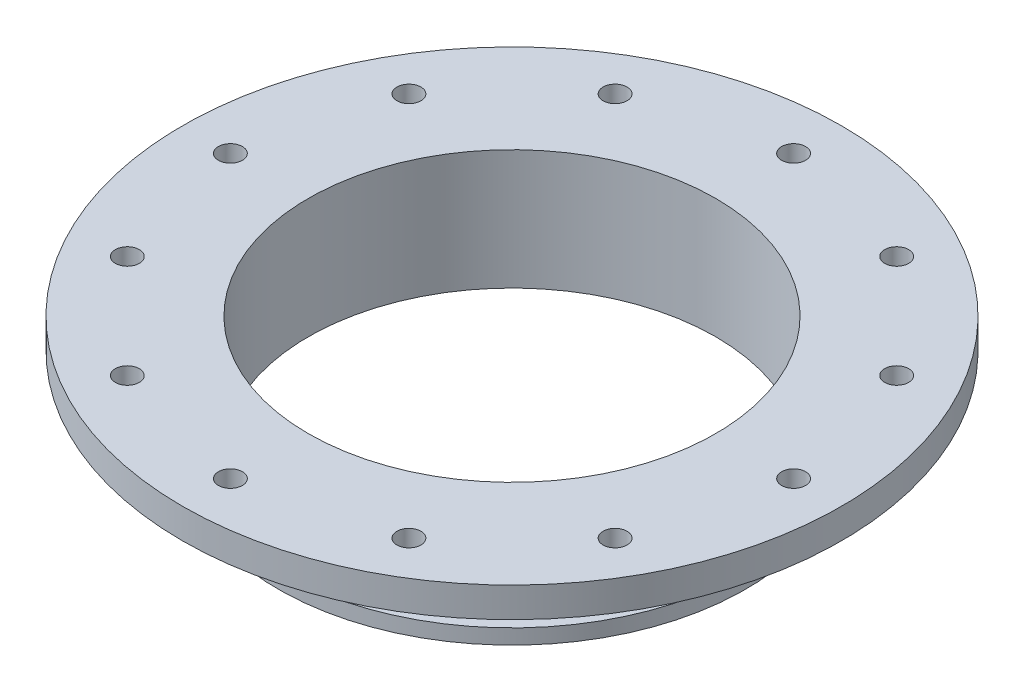
ISO-10303-21;
HEADER;
FILE_DESCRIPTION(('STEP AP214'),'2;1');
FILE_NAME('part.step','',(''),(''),'','','');
FILE_SCHEMA(('AUTOMOTIVE_DESIGN { 1 0 10303 214 1 1 1 1 }'));
ENDSEC;
DATA;
#1=APPLICATION_CONTEXT('core data for automotive mechanical design processes');
#2=APPLICATION_PROTOCOL_DEFINITION('international standard','automotive_design',2000,#1);
#3=PRODUCT_CONTEXT('',#1,'mechanical');
#4=PRODUCT('Part','Part','',(#3));
#5=PRODUCT_RELATED_PRODUCT_CATEGORY('part','',(#4));
#6=PRODUCT_DEFINITION_FORMATION('','',#4);
#7=PRODUCT_DEFINITION_CONTEXT('part definition',#1,'design');
#8=PRODUCT_DEFINITION('design','',#6,#7);
#9=PRODUCT_DEFINITION_SHAPE('','',#8);
#10=(LENGTH_UNIT() NAMED_UNIT(*) SI_UNIT(.MILLI.,.METRE.));
#11=(NAMED_UNIT(*) PLANE_ANGLE_UNIT() SI_UNIT($,.RADIAN.));
#12=(NAMED_UNIT(*) SI_UNIT($,.STERADIAN.) SOLID_ANGLE_UNIT());
#13=UNCERTAINTY_MEASURE_WITH_UNIT(LENGTH_MEASURE(1.E-05),#10,'distance_accuracy_value','');
#14=(GEOMETRIC_REPRESENTATION_CONTEXT(3) GLOBAL_UNCERTAINTY_ASSIGNED_CONTEXT((#13)) GLOBAL_UNIT_ASSIGNED_CONTEXT((#10,
#11,#12)) REPRESENTATION_CONTEXT('',''));
#15=CARTESIAN_POINT('',(0.,0.,0.));
#16=DIRECTION('',(0.,0.,1.));
#17=DIRECTION('',(1.,0.,0.));
#18=AXIS2_PLACEMENT_3D('',#15,#16,#17);
#19=CARTESIAN_POINT('',(0.,-25.4,0.));
#20=DIRECTION('',(0.,1.,0.));
#21=DIRECTION('',(0.,0.,1.));
#22=AXIS2_PLACEMENT_3D('',#19,#20,#21);
#23=CYLINDRICAL_SURFACE('',#22,49.53);
#24=CARTESIAN_POINT('',(0.,-6.35,0.));
#25=DIRECTION('',(0.,-1.,0.));
#26=DIRECTION('',(0.,0.,-1.));
#27=AXIS2_PLACEMENT_3D('',#24,#25,#26);
#28=CIRCLE('',#27,49.53);
#29=CARTESIAN_POINT('',(0.,-6.35,-49.53));
#30=VERTEX_POINT('',#29);
#31=EDGE_CURVE('E52',#30,#30,#28,.T.);
#32=ORIENTED_EDGE('',*,*,#31,.T.);
#33=EDGE_LOOP('',(#32));
#34=FACE_BOUND('',#33,.T.);
#35=CARTESIAN_POINT('',(0.,-9.52500000000001,0.));
#36=DIRECTION('',(0.,1.,0.));
#37=DIRECTION('',(-1.,0.,0.));
#38=AXIS2_PLACEMENT_3D('',#35,#36,#37);
#39=CIRCLE('',#38,49.53);
#40=CARTESIAN_POINT('',(-49.53,-9.52500000000001,0.));
#41=VERTEX_POINT('',#40);
#42=EDGE_CURVE('E61',#41,#41,#39,.T.);
#43=ORIENTED_EDGE('',*,*,#42,.T.);
#44=EDGE_LOOP('',(#43));
#45=FACE_BOUND('',#44,.T.);
#46=ADVANCED_FACE('F34',(#34,#45),#23,.T.);
#47=CARTESIAN_POINT('',(43.18,-6.35,0.));
#48=DIRECTION('',(0.,-1.,0.));
#49=DIRECTION('',(0.,0.,-1.));
#50=AXIS2_PLACEMENT_3D('',#47,#48,#49);
#51=PLANE('',#50);
#52=CARTESIAN_POINT('',(-29.8449999999999,-6.35,-51.6930563518932));
#53=DIRECTION('',(0.,-1.,0.));
#54=DIRECTION('',(0.,0.,-1.));
#55=AXIS2_PLACEMENT_3D('',#52,#53,#54);
#56=CIRCLE('',#55,2.54);
#57=CARTESIAN_POINT('',(-29.8449999999999,-6.35,-54.2330563518932));
#58=VERTEX_POINT('',#57);
#59=EDGE_CURVE('E102',#58,#58,#56,.T.);
#60=ORIENTED_EDGE('',*,*,#59,.F.);
#61=EDGE_LOOP('',(#60));
#62=FACE_BOUND('',#61,.T.);
#63=CARTESIAN_POINT('',(2.07162279967613E-13,-6.35,-59.69));
#64=DIRECTION('',(0.,-1.,0.));
#65=DIRECTION('',(0.,0.,-1.));
#66=AXIS2_PLACEMENT_3D('',#63,#64,#65);
#67=CIRCLE('',#66,2.54);
#68=CARTESIAN_POINT('',(2.07162279967613E-13,-6.35,-62.23));
#69=VERTEX_POINT('',#68);
#70=EDGE_CURVE('E105',#69,#69,#67,.T.);
#71=ORIENTED_EDGE('',*,*,#70,.F.);
#72=EDGE_LOOP('',(#71));
#73=FACE_BOUND('',#72,.T.);
#74=CARTESIAN_POINT('',(29.8450000000003,-6.35,-51.693056351893));
#75=DIRECTION('',(0.,-1.,0.));
#76=DIRECTION('',(0.,0.,-1.));
#77=AXIS2_PLACEMENT_3D('',#74,#75,#76);
#78=CIRCLE('',#77,2.54);
#79=CARTESIAN_POINT('',(29.8450000000003,-6.35,-54.233056351893));
#80=VERTEX_POINT('',#79);
#81=EDGE_CURVE('E108',#80,#80,#78,.T.);
#82=ORIENTED_EDGE('',*,*,#81,.F.);
#83=EDGE_LOOP('',(#82));
#84=FACE_BOUND('',#83,.T.);
#85=CARTESIAN_POINT('',(51.6930563518933,-6.35,-29.8449999999997));
#86=DIRECTION('',(0.,-1.,0.));
#87=DIRECTION('',(0.,0.,-1.));
#88=AXIS2_PLACEMENT_3D('',#85,#86,#87);
#89=CIRCLE('',#88,2.54);
#90=CARTESIAN_POINT('',(51.6930563518933,-6.35,-32.3849999999997));
#91=VERTEX_POINT('',#90);
#92=EDGE_CURVE('E111',#91,#91,#89,.T.);
#93=ORIENTED_EDGE('',*,*,#92,.F.);
#94=EDGE_LOOP('',(#93));
#95=FACE_BOUND('',#94,.T.);
#96=CARTESIAN_POINT('',(59.69,-6.35,0.));
#97=DIRECTION('',(0.,-1.,0.));
#98=DIRECTION('',(0.,0.,-1.));
#99=AXIS2_PLACEMENT_3D('',#96,#97,#98);
#100=CIRCLE('',#99,2.54);
#101=CARTESIAN_POINT('',(59.69,-6.35,-2.54));
#102=VERTEX_POINT('',#101);
#103=EDGE_CURVE('E114',#102,#102,#100,.T.);
#104=ORIENTED_EDGE('',*,*,#103,.F.);
#105=EDGE_LOOP('',(#104));
#106=FACE_BOUND('',#105,.T.);
#107=CARTESIAN_POINT('',(51.6930563518929,-6.35,29.8450000000004));
#108=DIRECTION('',(0.,-1.,0.));
#109=DIRECTION('',(0.,0.,-1.));
#110=AXIS2_PLACEMENT_3D('',#107,#108,#109);
#111=CIRCLE('',#110,2.54);
#112=CARTESIAN_POINT('',(51.6930563518929,-6.35,27.3050000000004));
#113=VERTEX_POINT('',#112);
#114=EDGE_CURVE('E117',#113,#113,#111,.T.);
#115=ORIENTED_EDGE('',*,*,#114,.F.);
#116=EDGE_LOOP('',(#115));
#117=FACE_BOUND('',#116,.T.);
#118=CARTESIAN_POINT('',(29.8449999999995,-6.35,51.6930563518934));
#119=DIRECTION('',(0.,-1.,0.));
#120=DIRECTION('',(0.,0.,-1.));
#121=AXIS2_PLACEMENT_3D('',#118,#119,#120);
#122=CIRCLE('',#121,2.54);
#123=CARTESIAN_POINT('',(29.8449999999995,-6.35,49.1530563518934));
#124=VERTEX_POINT('',#123);
#125=EDGE_CURVE('E120',#124,#124,#122,.T.);
#126=ORIENTED_EDGE('',*,*,#125,.F.);
#127=EDGE_LOOP('',(#126));
#128=FACE_BOUND('',#127,.T.);
#129=CARTESIAN_POINT('',(-6.23975322198706E-13,-6.35,59.69));
#130=DIRECTION('',(0.,-1.,0.));
#131=DIRECTION('',(0.,0.,-1.));
#132=AXIS2_PLACEMENT_3D('',#129,#130,#131);
#133=CIRCLE('',#132,2.54);
#134=CARTESIAN_POINT('',(-6.23975322198706E-13,-6.35,57.15));
#135=VERTEX_POINT('',#134);
#136=EDGE_CURVE('E123',#135,#135,#133,.T.);
#137=ORIENTED_EDGE('',*,*,#136,.F.);
#138=EDGE_LOOP('',(#137));
#139=FACE_BOUND('',#138,.T.);
#140=CARTESIAN_POINT('',(-29.8450000000006,-6.35,51.6930563518928));
#141=DIRECTION('',(0.,-1.,0.));
#142=DIRECTION('',(0.,0.,-1.));
#143=AXIS2_PLACEMENT_3D('',#140,#141,#142);
#144=CIRCLE('',#143,2.54);
#145=CARTESIAN_POINT('',(-29.8450000000006,-6.35,49.1530563518928));
#146=VERTEX_POINT('',#145);
#147=EDGE_CURVE('E126',#146,#146,#144,.T.);
#148=ORIENTED_EDGE('',*,*,#147,.F.);
#149=EDGE_LOOP('',(#148));
#150=FACE_BOUND('',#149,.T.);
#151=CARTESIAN_POINT('',(-51.6930563518935,-6.35,29.8449999999993));
#152=DIRECTION('',(0.,-1.,0.));
#153=DIRECTION('',(0.,0.,-1.));
#154=AXIS2_PLACEMENT_3D('',#151,#152,#153);
#155=CIRCLE('',#154,2.54);
#156=CARTESIAN_POINT('',(-51.6930563518935,-6.35,27.3049999999993));
#157=VERTEX_POINT('',#156);
#158=EDGE_CURVE('E129',#157,#157,#155,.T.);
#159=ORIENTED_EDGE('',*,*,#158,.F.);
#160=EDGE_LOOP('',(#159));
#161=FACE_BOUND('',#160,.T.);
#162=CARTESIAN_POINT('',(-51.6930563518931,-6.35,-29.8450000000001));
#163=DIRECTION('',(0.,-1.,0.));
#164=DIRECTION('',(0.,0.,-1.));
#165=AXIS2_PLACEMENT_3D('',#162,#163,#164);
#166=CIRCLE('',#165,2.54);
#167=CARTESIAN_POINT('',(-51.6930563518931,-6.35,-32.3850000000001));
#168=VERTEX_POINT('',#167);
#169=EDGE_CURVE('E132',#168,#168,#166,.T.);
#170=ORIENTED_EDGE('',*,*,#169,.F.);
#171=EDGE_LOOP('',(#170));
#172=FACE_BOUND('',#171,.T.);
#173=CARTESIAN_POINT('',(-59.69,-6.35,0.));
#174=DIRECTION('',(0.,-1.,0.));
#175=DIRECTION('',(0.,0.,-1.));
#176=AXIS2_PLACEMENT_3D('',#173,#174,#175);
#177=CIRCLE('',#176,2.54);
#178=CARTESIAN_POINT('',(-59.69,-6.35,-2.54));
#179=VERTEX_POINT('',#178);
#180=EDGE_CURVE('E74',#179,#179,#177,.T.);
#181=ORIENTED_EDGE('',*,*,#180,.F.);
#182=EDGE_LOOP('',(#181));
#183=FACE_BOUND('',#182,.T.);
#184=CARTESIAN_POINT('',(0.,-6.34999999999999,0.));
#185=DIRECTION('',(0.,-1.,0.));
#186=DIRECTION('',(0.,0.,-1.));
#187=AXIS2_PLACEMENT_3D('',#184,#185,#186);
#188=CIRCLE('',#187,69.85);
#189=CARTESIAN_POINT('',(0.,-6.34999999999999,-69.85));
#190=VERTEX_POINT('',#189);
#191=EDGE_CURVE('E41',#190,#190,#188,.T.);
#192=ORIENTED_EDGE('',*,*,#191,.T.);
#193=EDGE_LOOP('',(#192));
#194=FACE_BOUND('',#193,.T.);
#195=ORIENTED_EDGE('',*,*,#31,.F.);
#196=EDGE_LOOP('',(#195));
#197=FACE_BOUND('',#196,.T.);
#198=ADVANCED_FACE('F174',(#62,#73,#84,#95,#106,#117,#128,#139,#150,#161,#172,#183,#194,#197),
#51,.T.);
#199=CARTESIAN_POINT('',(43.18,0.,0.));
#200=DIRECTION('',(0.,1.,0.));
#201=DIRECTION('',(0.,0.,1.));
#202=AXIS2_PLACEMENT_3D('',#199,#200,#201);
#203=PLANE('',#202);
#204=CARTESIAN_POINT('',(-29.8449999999999,0.,-51.6930563518932));
#205=DIRECTION('',(0.,1.,0.));
#206=DIRECTION('',(-0.86602540378444,0.,0.499999999999998));
#207=AXIS2_PLACEMENT_3D('',#204,#205,#206);
#208=CIRCLE('',#207,2.54);
#209=CARTESIAN_POINT('',(-32.0447045256124,0.,-50.4230563518932));
#210=VERTEX_POINT('',#209);
#211=EDGE_CURVE('E138',#210,#210,#208,.T.);
#212=ORIENTED_EDGE('',*,*,#211,.F.);
#213=EDGE_LOOP('',(#212));
#214=FACE_BOUND('',#213,.T.);
#215=CARTESIAN_POINT('',(2.07162279967613E-13,0.,-59.69));
#216=DIRECTION('',(0.,1.,0.));
#217=DIRECTION('',(-1.,0.,0.));
#218=AXIS2_PLACEMENT_3D('',#215,#216,#217);
#219=CIRCLE('',#218,2.54);
#220=CARTESIAN_POINT('',(-2.53999999999979,0.,-59.69));
#221=VERTEX_POINT('',#220);
#222=EDGE_CURVE('E158',#221,#221,#219,.T.);
#223=ORIENTED_EDGE('',*,*,#222,.F.);
#224=EDGE_LOOP('',(#223));
#225=FACE_BOUND('',#224,.T.);
#226=CARTESIAN_POINT('',(29.8450000000003,0.,-51.693056351893));
#227=DIRECTION('',(0.,1.,0.));
#228=DIRECTION('',(-0.866025403784436,0.,-0.500000000000004));
#229=AXIS2_PLACEMENT_3D('',#226,#227,#228);
#230=CIRCLE('',#229,2.54);
#231=CARTESIAN_POINT('',(27.6452954743878,0.,-52.963056351893));
#232=VERTEX_POINT('',#231);
#233=EDGE_CURVE('E155',#232,#232,#230,.T.);
#234=ORIENTED_EDGE('',*,*,#233,.F.);
#235=EDGE_LOOP('',(#234));
#236=FACE_BOUND('',#235,.T.);
#237=CARTESIAN_POINT('',(51.6930563518933,0.,-29.8449999999997));
#238=DIRECTION('',(0.,1.,0.));
#239=DIRECTION('',(-0.499999999999995,0.,-0.866025403784442));
#240=AXIS2_PLACEMENT_3D('',#237,#238,#239);
#241=CIRCLE('',#240,2.54);
#242=CARTESIAN_POINT('',(50.4230563518933,0.,-32.0447045256122));
#243=VERTEX_POINT('',#242);
#244=EDGE_CURVE('E152',#243,#243,#241,.T.);
#245=ORIENTED_EDGE('',*,*,#244,.F.);
#246=EDGE_LOOP('',(#245));
#247=FACE_BOUND('',#246,.T.);
#248=CARTESIAN_POINT('',(59.69,0.,0.));
#249=DIRECTION('',(0.,1.,0.));
#250=DIRECTION('',(0.,0.,-1.));
#251=AXIS2_PLACEMENT_3D('',#248,#249,#250);
#252=CIRCLE('',#251,2.54);
#253=CARTESIAN_POINT('',(59.69,0.,-2.54));
#254=VERTEX_POINT('',#253);
#255=EDGE_CURVE('E149',#254,#254,#252,.T.);
#256=ORIENTED_EDGE('',*,*,#255,.F.);
#257=EDGE_LOOP('',(#256));
#258=FACE_BOUND('',#257,.T.);
#259=CARTESIAN_POINT('',(51.6930563518929,0.,29.8450000000004));
#260=DIRECTION('',(0.,1.,0.));
#261=DIRECTION('',(0.500000000000007,0.,-0.866025403784435));
#262=AXIS2_PLACEMENT_3D('',#259,#260,#261);
#263=CIRCLE('',#262,2.54);
#264=CARTESIAN_POINT('',(52.9630563518929,0.,27.645295474388));
#265=VERTEX_POINT('',#264);
#266=EDGE_CURVE('E146',#265,#265,#263,.T.);
#267=ORIENTED_EDGE('',*,*,#266,.F.);
#268=EDGE_LOOP('',(#267));
#269=FACE_BOUND('',#268,.T.);
#270=CARTESIAN_POINT('',(29.8449999999995,0.,51.6930563518934));
#271=DIRECTION('',(0.,1.,0.));
#272=DIRECTION('',(0.866025403784443,0.,-0.499999999999992));
#273=AXIS2_PLACEMENT_3D('',#270,#271,#272);
#274=CIRCLE('',#273,2.54);
#275=CARTESIAN_POINT('',(32.044704525612,0.,50.4230563518935));
#276=VERTEX_POINT('',#275);
#277=EDGE_CURVE('E142',#276,#276,#274,.T.);
#278=ORIENTED_EDGE('',*,*,#277,.F.);
#279=EDGE_LOOP('',(#278));
#280=FACE_BOUND('',#279,.T.);
#281=CARTESIAN_POINT('',(-6.23975322198706E-13,0.,59.69));
#282=DIRECTION('',(0.,1.,0.));
#283=DIRECTION('',(1.,0.,0.));
#284=AXIS2_PLACEMENT_3D('',#281,#282,#283);
#285=CIRCLE('',#284,2.54);
#286=CARTESIAN_POINT('',(2.53999999999938,0.,59.69));
#287=VERTEX_POINT('',#286);
#288=EDGE_CURVE('E139',#287,#287,#285,.T.);
#289=ORIENTED_EDGE('',*,*,#288,.F.);
#290=EDGE_LOOP('',(#289));
#291=FACE_BOUND('',#290,.T.);
#292=CARTESIAN_POINT('',(-29.8450000000006,0.,51.6930563518928));
#293=DIRECTION('',(0.,1.,0.));
#294=DIRECTION('',(0.866025403784433,0.,0.50000000000001));
#295=AXIS2_PLACEMENT_3D('',#292,#293,#294);
#296=CIRCLE('',#295,2.54);
#297=CARTESIAN_POINT('',(-27.6452954743881,0.,52.9630563518928));
#298=VERTEX_POINT('',#297);
#299=EDGE_CURVE('E143',#298,#298,#296,.T.);
#300=ORIENTED_EDGE('',*,*,#299,.F.);
#301=EDGE_LOOP('',(#300));
#302=FACE_BOUND('',#301,.T.);
#303=CARTESIAN_POINT('',(-51.6930563518935,0.,29.8449999999993));
#304=DIRECTION('',(0.,1.,0.));
#305=DIRECTION('',(0.499999999999989,0.,0.866025403784445));
#306=AXIS2_PLACEMENT_3D('',#303,#304,#305);
#307=CIRCLE('',#306,2.54);
#308=CARTESIAN_POINT('',(-50.4230563518936,0.,32.0447045256118));
#309=VERTEX_POINT('',#308);
#310=EDGE_CURVE('E163',#309,#309,#307,.T.);
#311=ORIENTED_EDGE('',*,*,#310,.F.);
#312=EDGE_LOOP('',(#311));
#313=FACE_BOUND('',#312,.T.);
#314=CARTESIAN_POINT('',(-51.6930563518931,0.,-29.8450000000001));
#315=DIRECTION('',(0.,1.,0.));
#316=DIRECTION('',(-0.500000000000001,0.,0.866025403784438));
#317=AXIS2_PLACEMENT_3D('',#314,#315,#316);
#318=CIRCLE('',#317,2.54);
#319=CARTESIAN_POINT('',(-52.9630563518931,0.,-27.6452954743876));
#320=VERTEX_POINT('',#319);
#321=EDGE_CURVE('E135',#320,#320,#318,.T.);
#322=ORIENTED_EDGE('',*,*,#321,.F.);
#323=EDGE_LOOP('',(#322));
#324=FACE_BOUND('',#323,.T.);
#325=CARTESIAN_POINT('',(-59.69,0.,0.));
#326=DIRECTION('',(0.,1.,0.));
#327=DIRECTION('',(0.,0.,1.));
#328=AXIS2_PLACEMENT_3D('',#325,#326,#327);
#329=CIRCLE('',#328,2.54);
#330=CARTESIAN_POINT('',(-59.69,0.,2.54));
#331=VERTEX_POINT('',#330);
#332=EDGE_CURVE('E99',#331,#331,#329,.T.);
#333=ORIENTED_EDGE('',*,*,#332,.F.);
#334=EDGE_LOOP('',(#333));
#335=FACE_BOUND('',#334,.T.);
#336=CARTESIAN_POINT('',(0.,0.,0.));
#337=DIRECTION('',(0.,-1.,0.));
#338=DIRECTION('',(0.,0.,-1.));
#339=AXIS2_PLACEMENT_3D('',#336,#337,#338);
#340=CIRCLE('',#339,43.18);
#341=CARTESIAN_POINT('',(0.,0.,-43.18));
#342=VERTEX_POINT('',#341);
#343=EDGE_CURVE('E10',#342,#342,#340,.T.);
#344=ORIENTED_EDGE('',*,*,#343,.T.);
#345=EDGE_LOOP('',(#344));
#346=FACE_BOUND('',#345,.T.);
#347=CARTESIAN_POINT('',(0.,0.,0.));
#348=DIRECTION('',(0.,-1.,0.));
#349=DIRECTION('',(0.,0.,-1.));
#350=AXIS2_PLACEMENT_3D('',#347,#348,#349);
#351=CIRCLE('',#350,69.85);
#352=CARTESIAN_POINT('',(0.,0.,-69.85));
#353=VERTEX_POINT('',#352);
#354=EDGE_CURVE('E45',#353,#353,#351,.T.);
#355=ORIENTED_EDGE('',*,*,#354,.F.);
#356=EDGE_LOOP('',(#355));
#357=FACE_BOUND('',#356,.T.);
#358=ADVANCED_FACE('F36',(#214,#225,#236,#247,#258,#269,#280,#291,#302,#313,#324,#335,#346,
#357),#203,.T.);
#359=CARTESIAN_POINT('',(0.,-127.,0.));
#360=DIRECTION('',(0.,-1.,0.));
#361=DIRECTION('',(0.,0.,-1.));
#362=AXIS2_PLACEMENT_3D('',#359,#360,#361);
#363=CYLINDRICAL_SURFACE('',#362,43.18);
#364=ORIENTED_EDGE('',*,*,#343,.F.);
#365=EDGE_LOOP('',(#364));
#366=FACE_BOUND('',#365,.T.);
#367=CARTESIAN_POINT('',(0.,-25.4,0.));
#368=DIRECTION('',(0.,-1.,0.));
#369=DIRECTION('',(0.,0.,-1.));
#370=AXIS2_PLACEMENT_3D('',#367,#368,#369);
#371=CIRCLE('',#370,43.18);
#372=CARTESIAN_POINT('',(0.,-25.4,-43.18));
#373=VERTEX_POINT('',#372);
#374=EDGE_CURVE('E55',#373,#373,#371,.T.);
#375=ORIENTED_EDGE('',*,*,#374,.T.);
#376=EDGE_LOOP('',(#375));
#377=FACE_BOUND('',#376,.T.);
#378=ADVANCED_FACE('F173',(#366,#377),#363,.F.);
#379=CARTESIAN_POINT('',(0.,-127.,0.));
#380=DIRECTION('',(0.,-1.,0.));
#381=DIRECTION('',(0.,0.,-1.));
#382=AXIS2_PLACEMENT_3D('',#379,#380,#381);
#383=CYLINDRICAL_SURFACE('',#382,69.85);
#384=ORIENTED_EDGE('',*,*,#354,.T.);
#385=EDGE_LOOP('',(#384));
#386=FACE_BOUND('',#385,.T.);
#387=ORIENTED_EDGE('',*,*,#191,.F.);
#388=EDGE_LOOP('',(#387));
#389=FACE_BOUND('',#388,.T.);
#390=ADVANCED_FACE('F184',(#386,#389),#383,.T.);
#391=CARTESIAN_POINT('',(0.,-25.4,0.));
#392=DIRECTION('',(0.,-1.,0.));
#393=DIRECTION('',(0.,0.,-1.));
#394=AXIS2_PLACEMENT_3D('',#391,#392,#393);
#395=PLANE('',#394);
#396=CARTESIAN_POINT('',(0.,-25.4,0.));
#397=DIRECTION('',(0.,-1.,0.));
#398=DIRECTION('',(0.,0.,-1.));
#399=AXIS2_PLACEMENT_3D('',#396,#397,#398);
#400=CIRCLE('',#399,49.53);
#401=CARTESIAN_POINT('',(0.,-25.4,-49.53));
#402=VERTEX_POINT('',#401);
#403=EDGE_CURVE('E49',#402,#402,#400,.T.);
#404=ORIENTED_EDGE('',*,*,#403,.T.);
#405=EDGE_LOOP('',(#404));
#406=FACE_BOUND('',#405,.T.);
#407=ORIENTED_EDGE('',*,*,#374,.F.);
#408=EDGE_LOOP('',(#407));
#409=FACE_BOUND('',#408,.T.);
#410=ADVANCED_FACE('F187',(#406,#409),#395,.T.);
#411=CARTESIAN_POINT('',(0.,-22.225,0.));
#412=DIRECTION('',(0.,1.,0.));
#413=DIRECTION('',(-1.,0.,0.));
#414=AXIS2_PLACEMENT_3D('',#411,#412,#413);
#415=CIRCLE('',#414,49.53);
#416=CARTESIAN_POINT('',(-49.53,-22.225,0.));
#417=VERTEX_POINT('',#416);
#418=EDGE_CURVE('E78',#417,#417,#415,.T.);
#419=ORIENTED_EDGE('',*,*,#418,.F.);
#420=EDGE_LOOP('',(#419));
#421=FACE_BOUND('',#420,.T.);
#422=ORIENTED_EDGE('',*,*,#403,.F.);
#423=EDGE_LOOP('',(#422));
#424=FACE_BOUND('',#423,.T.);
#425=ADVANCED_FACE('F193',(#421,#424),#23,.T.);
#426=CARTESIAN_POINT('',(0.,-9.52500000000001,0.));
#427=DIRECTION('',(0.,-1.,0.));
#428=DIRECTION('',(1.,0.,0.));
#429=AXIS2_PLACEMENT_3D('',#426,#427,#428);
#430=PLANE('',#429);
#431=CARTESIAN_POINT('',(0.,-9.52500000000001,0.));
#432=DIRECTION('',(0.,1.,0.));
#433=DIRECTION('',(-1.,0.,0.));
#434=AXIS2_PLACEMENT_3D('',#431,#432,#433);
#435=CIRCLE('',#434,46.355);
#436=CARTESIAN_POINT('',(-46.355,-9.52500000000001,0.));
#437=VERTEX_POINT('',#436);
#438=EDGE_CURVE('E65',#437,#437,#435,.T.);
#439=ORIENTED_EDGE('',*,*,#438,.T.);
#440=EDGE_LOOP('',(#439));
#441=FACE_BOUND('',#440,.T.);
#442=ORIENTED_EDGE('',*,*,#42,.F.);
#443=EDGE_LOOP('',(#442));
#444=FACE_BOUND('',#443,.T.);
#445=ADVANCED_FACE('F209',(#441,#444),#430,.T.);
#446=CARTESIAN_POINT('',(0.,0.,0.));
#447=DIRECTION('',(0.,1.,0.));
#448=DIRECTION('',(-1.,0.,0.));
#449=AXIS2_PLACEMENT_3D('',#446,#447,#448);
#450=CYLINDRICAL_SURFACE('',#449,46.355);
#451=ORIENTED_EDGE('',*,*,#438,.F.);
#452=EDGE_LOOP('',(#451));
#453=FACE_BOUND('',#452,.T.);
#454=CARTESIAN_POINT('',(0.,-11.6416666666667,0.));
#455=DIRECTION('',(0.,1.,0.));
#456=DIRECTION('',(-1.,0.,0.));
#457=AXIS2_PLACEMENT_3D('',#454,#455,#456);
#458=CIRCLE('',#457,46.355);
#459=CARTESIAN_POINT('',(-46.355,-11.6416666666667,0.));
#460=VERTEX_POINT('',#459);
#461=EDGE_CURVE('E68',#460,#460,#458,.T.);
#462=ORIENTED_EDGE('',*,*,#461,.T.);
#463=EDGE_LOOP('',(#462));
#464=FACE_BOUND('',#463,.T.);
#465=ADVANCED_FACE('F244',(#453,#464),#450,.T.);
#466=CARTESIAN_POINT('',(0.,-11.6416666666667,0.));
#467=DIRECTION('',(0.,-1.,0.));
#468=DIRECTION('',(1.,0.,0.));
#469=AXIS2_PLACEMENT_3D('',#466,#467,#468);
#470=PLANE('',#469);
#471=ORIENTED_EDGE('',*,*,#461,.F.);
#472=EDGE_LOOP('',(#471));
#473=FACE_BOUND('',#472,.T.);
#474=CARTESIAN_POINT('',(0.,-11.6416666666667,0.));
#475=DIRECTION('',(0.,1.,0.));
#476=DIRECTION('',(-1.,0.,0.));
#477=AXIS2_PLACEMENT_3D('',#474,#475,#476);
#478=CIRCLE('',#477,49.53);
#479=CARTESIAN_POINT('',(-49.53,-11.6416666666667,0.));
#480=VERTEX_POINT('',#479);
#481=EDGE_CURVE('E71',#480,#480,#478,.T.);
#482=ORIENTED_EDGE('',*,*,#481,.T.);
#483=EDGE_LOOP('',(#482));
#484=FACE_BOUND('',#483,.T.);
#485=ADVANCED_FACE('F240',(#473,#484),#470,.F.);
#486=CARTESIAN_POINT('',(0.,-20.1083333333333,0.));
#487=DIRECTION('',(0.,-1.,0.));
#488=DIRECTION('',(1.,0.,0.));
#489=AXIS2_PLACEMENT_3D('',#486,#487,#488);
#490=PLANE('',#489);
#491=CARTESIAN_POINT('',(0.,-20.1083333333333,0.));
#492=DIRECTION('',(0.,1.,0.));
#493=DIRECTION('',(-1.,0.,0.));
#494=AXIS2_PLACEMENT_3D('',#491,#492,#493);
#495=CIRCLE('',#494,46.355);
#496=CARTESIAN_POINT('',(-46.355,-20.1083333333333,0.));
#497=VERTEX_POINT('',#496);
#498=EDGE_CURVE('E89',#497,#497,#495,.T.);
#499=ORIENTED_EDGE('',*,*,#498,.T.);
#500=EDGE_LOOP('',(#499));
#501=FACE_BOUND('',#500,.T.);
#502=CARTESIAN_POINT('',(0.,-20.1083333333333,0.));
#503=DIRECTION('',(0.,1.,0.));
#504=DIRECTION('',(-1.,0.,0.));
#505=AXIS2_PLACEMENT_3D('',#502,#503,#504);
#506=CIRCLE('',#505,49.53);
#507=CARTESIAN_POINT('',(-49.53,-20.1083333333333,0.));
#508=VERTEX_POINT('',#507);
#509=EDGE_CURVE('E60',#508,#508,#506,.T.);
#510=ORIENTED_EDGE('',*,*,#509,.F.);
#511=EDGE_LOOP('',(#510));
#512=FACE_BOUND('',#511,.T.);
#513=ADVANCED_FACE('F243',(#501,#512),#490,.T.);
#514=CARTESIAN_POINT('',(0.,0.,0.));
#515=DIRECTION('',(0.,1.,0.));
#516=DIRECTION('',(-1.,0.,0.));
#517=AXIS2_PLACEMENT_3D('',#514,#515,#516);
#518=CYLINDRICAL_SURFACE('',#517,46.355);
#519=ORIENTED_EDGE('',*,*,#498,.F.);
#520=EDGE_LOOP('',(#519));
#521=FACE_BOUND('',#520,.T.);
#522=CARTESIAN_POINT('',(0.,-22.225,0.));
#523=DIRECTION('',(0.,1.,0.));
#524=DIRECTION('',(-1.,0.,0.));
#525=AXIS2_PLACEMENT_3D('',#522,#523,#524);
#526=CIRCLE('',#525,46.355);
#527=CARTESIAN_POINT('',(-46.355,-22.225,0.));
#528=VERTEX_POINT('',#527);
#529=EDGE_CURVE('E92',#528,#528,#526,.T.);
#530=ORIENTED_EDGE('',*,*,#529,.T.);
#531=EDGE_LOOP('',(#530));
#532=FACE_BOUND('',#531,.T.);
#533=ADVANCED_FACE('F221',(#521,#532),#518,.T.);
#534=CARTESIAN_POINT('',(0.,-22.225,0.));
#535=DIRECTION('',(0.,-1.,0.));
#536=DIRECTION('',(1.,0.,0.));
#537=AXIS2_PLACEMENT_3D('',#534,#535,#536);
#538=PLANE('',#537);
#539=ORIENTED_EDGE('',*,*,#529,.F.);
#540=EDGE_LOOP('',(#539));
#541=FACE_BOUND('',#540,.T.);
#542=ORIENTED_EDGE('',*,*,#418,.T.);
#543=EDGE_LOOP('',(#542));
#544=FACE_BOUND('',#543,.T.);
#545=ADVANCED_FACE('F213',(#541,#544),#538,.F.);
#546=ORIENTED_EDGE('',*,*,#481,.F.);
#547=EDGE_LOOP('',(#546));
#548=FACE_BOUND('',#547,.T.);
#549=CARTESIAN_POINT('',(0.,-14.8166666666667,0.));
#550=DIRECTION('',(0.,1.,0.));
#551=DIRECTION('',(-1.,0.,0.));
#552=AXIS2_PLACEMENT_3D('',#549,#550,#551);
#553=CIRCLE('',#552,49.53);
#554=CARTESIAN_POINT('',(-49.53,-14.8166666666667,0.));
#555=VERTEX_POINT('',#554);
#556=EDGE_CURVE('E75',#555,#555,#553,.T.);
#557=ORIENTED_EDGE('',*,*,#556,.T.);
#558=EDGE_LOOP('',(#557));
#559=FACE_BOUND('',#558,.T.);
#560=ADVANCED_FACE('F201',(#548,#559),#23,.T.);
#561=CARTESIAN_POINT('',(0.,-16.9333333333333,0.));
#562=DIRECTION('',(0.,1.,0.));
#563=DIRECTION('',(-1.,0.,0.));
#564=AXIS2_PLACEMENT_3D('',#561,#562,#563);
#565=CIRCLE('',#564,49.53);
#566=CARTESIAN_POINT('',(-49.53,-16.9333333333333,0.));
#567=VERTEX_POINT('',#566);
#568=EDGE_CURVE('E64',#567,#567,#565,.T.);
#569=ORIENTED_EDGE('',*,*,#568,.F.);
#570=EDGE_LOOP('',(#569));
#571=FACE_BOUND('',#570,.T.);
#572=ORIENTED_EDGE('',*,*,#509,.T.);
#573=EDGE_LOOP('',(#572));
#574=FACE_BOUND('',#573,.T.);
#575=ADVANCED_FACE('F211',(#571,#574),#23,.T.);
#576=CARTESIAN_POINT('',(0.,-14.8166666666667,0.));
#577=DIRECTION('',(0.,-1.,0.));
#578=DIRECTION('',(1.,0.,0.));
#579=AXIS2_PLACEMENT_3D('',#576,#577,#578);
#580=PLANE('',#579);
#581=CARTESIAN_POINT('',(0.,-14.8166666666667,0.));
#582=DIRECTION('',(0.,1.,0.));
#583=DIRECTION('',(-1.,0.,0.));
#584=AXIS2_PLACEMENT_3D('',#581,#582,#583);
#585=CIRCLE('',#584,46.355);
#586=CARTESIAN_POINT('',(-46.355,-14.8166666666667,0.));
#587=VERTEX_POINT('',#586);
#588=EDGE_CURVE('E79',#587,#587,#585,.T.);
#589=ORIENTED_EDGE('',*,*,#588,.T.);
#590=EDGE_LOOP('',(#589));
#591=FACE_BOUND('',#590,.T.);
#592=ORIENTED_EDGE('',*,*,#556,.F.);
#593=EDGE_LOOP('',(#592));
#594=FACE_BOUND('',#593,.T.);
#595=ADVANCED_FACE('F219',(#591,#594),#580,.T.);
#596=CARTESIAN_POINT('',(0.,0.,0.));
#597=DIRECTION('',(0.,1.,0.));
#598=DIRECTION('',(-1.,0.,0.));
#599=AXIS2_PLACEMENT_3D('',#596,#597,#598);
#600=CYLINDRICAL_SURFACE('',#599,46.355);
#601=ORIENTED_EDGE('',*,*,#588,.F.);
#602=EDGE_LOOP('',(#601));
#603=FACE_BOUND('',#602,.T.);
#604=CARTESIAN_POINT('',(0.,-16.9333333333333,0.));
#605=DIRECTION('',(0.,1.,0.));
#606=DIRECTION('',(-1.,0.,0.));
#607=AXIS2_PLACEMENT_3D('',#604,#605,#606);
#608=CIRCLE('',#607,46.355);
#609=CARTESIAN_POINT('',(-46.355,-16.9333333333333,0.));
#610=VERTEX_POINT('',#609);
#611=EDGE_CURVE('E82',#610,#610,#608,.T.);
#612=ORIENTED_EDGE('',*,*,#611,.T.);
#613=EDGE_LOOP('',(#612));
#614=FACE_BOUND('',#613,.T.);
#615=ADVANCED_FACE('F229',(#603,#614),#600,.T.);
#616=CARTESIAN_POINT('',(0.,-16.9333333333333,0.));
#617=DIRECTION('',(0.,-1.,0.));
#618=DIRECTION('',(1.,0.,0.));
#619=AXIS2_PLACEMENT_3D('',#616,#617,#618);
#620=PLANE('',#619);
#621=ORIENTED_EDGE('',*,*,#611,.F.);
#622=EDGE_LOOP('',(#621));
#623=FACE_BOUND('',#622,.T.);
#624=ORIENTED_EDGE('',*,*,#568,.T.);
#625=EDGE_LOOP('',(#624));
#626=FACE_BOUND('',#625,.T.);
#627=ADVANCED_FACE('F235',(#623,#626),#620,.F.);
#628=CARTESIAN_POINT('',(-59.69,-25.4,0.));
#629=DIRECTION('',(0.,1.,0.));
#630=DIRECTION('',(0.,0.,1.));
#631=AXIS2_PLACEMENT_3D('',#628,#629,#630);
#632=CYLINDRICAL_SURFACE('',#631,2.54);
#633=ORIENTED_EDGE('',*,*,#180,.T.);
#634=EDGE_LOOP('',(#633));
#635=FACE_BOUND('',#634,.T.);
#636=ORIENTED_EDGE('',*,*,#332,.T.);
#637=EDGE_LOOP('',(#636));
#638=FACE_BOUND('',#637,.T.);
#639=ADVANCED_FACE('F318',(#635,#638),#632,.F.);
#640=CARTESIAN_POINT('',(-51.6930563518931,-25.4,-29.8450000000001));
#641=DIRECTION('',(0.,1.,0.));
#642=DIRECTION('',(0.,0.,1.));
#643=AXIS2_PLACEMENT_3D('',#640,#641,#642);
#644=CYLINDRICAL_SURFACE('',#643,2.54);
#645=ORIENTED_EDGE('',*,*,#169,.T.);
#646=EDGE_LOOP('',(#645));
#647=FACE_BOUND('',#646,.T.);
#648=ORIENTED_EDGE('',*,*,#321,.T.);
#649=EDGE_LOOP('',(#648));
#650=FACE_BOUND('',#649,.T.);
#651=ADVANCED_FACE('F326',(#647,#650),#644,.F.);
#652=CARTESIAN_POINT('',(-51.6930563518935,-25.4,29.8449999999993));
#653=DIRECTION('',(0.,1.,0.));
#654=DIRECTION('',(0.,0.,1.));
#655=AXIS2_PLACEMENT_3D('',#652,#653,#654);
#656=CYLINDRICAL_SURFACE('',#655,2.54);
#657=ORIENTED_EDGE('',*,*,#158,.T.);
#658=EDGE_LOOP('',(#657));
#659=FACE_BOUND('',#658,.T.);
#660=ORIENTED_EDGE('',*,*,#310,.T.);
#661=EDGE_LOOP('',(#660));
#662=FACE_BOUND('',#661,.T.);
#663=ADVANCED_FACE('F344',(#659,#662),#656,.F.);
#664=CARTESIAN_POINT('',(-29.8450000000006,-25.4,51.6930563518928));
#665=DIRECTION('',(0.,1.,0.));
#666=DIRECTION('',(0.,0.,1.));
#667=AXIS2_PLACEMENT_3D('',#664,#665,#666);
#668=CYLINDRICAL_SURFACE('',#667,2.54);
#669=ORIENTED_EDGE('',*,*,#147,.T.);
#670=EDGE_LOOP('',(#669));
#671=FACE_BOUND('',#670,.T.);
#672=ORIENTED_EDGE('',*,*,#299,.T.);
#673=EDGE_LOOP('',(#672));
#674=FACE_BOUND('',#673,.T.);
#675=ADVANCED_FACE('F169',(#671,#674),#668,.F.);
#676=CARTESIAN_POINT('',(-6.23975322198706E-13,-25.4,59.69));
#677=DIRECTION('',(0.,1.,0.));
#678=DIRECTION('',(0.,0.,1.));
#679=AXIS2_PLACEMENT_3D('',#676,#677,#678);
#680=CYLINDRICAL_SURFACE('',#679,2.54);
#681=ORIENTED_EDGE('',*,*,#136,.T.);
#682=EDGE_LOOP('',(#681));
#683=FACE_BOUND('',#682,.T.);
#684=ORIENTED_EDGE('',*,*,#288,.T.);
#685=EDGE_LOOP('',(#684));
#686=FACE_BOUND('',#685,.T.);
#687=ADVANCED_FACE('F363',(#683,#686),#680,.F.);
#688=CARTESIAN_POINT('',(29.8449999999995,-25.4,51.6930563518934));
#689=DIRECTION('',(0.,1.,0.));
#690=DIRECTION('',(0.,0.,1.));
#691=AXIS2_PLACEMENT_3D('',#688,#689,#690);
#692=CYLINDRICAL_SURFACE('',#691,2.54);
#693=ORIENTED_EDGE('',*,*,#125,.T.);
#694=EDGE_LOOP('',(#693));
#695=FACE_BOUND('',#694,.T.);
#696=ORIENTED_EDGE('',*,*,#277,.T.);
#697=EDGE_LOOP('',(#696));
#698=FACE_BOUND('',#697,.T.);
#699=ADVANCED_FACE('F373',(#695,#698),#692,.F.);
#700=CARTESIAN_POINT('',(51.6930563518929,-25.4,29.8450000000004));
#701=DIRECTION('',(0.,1.,0.));
#702=DIRECTION('',(0.,0.,1.));
#703=AXIS2_PLACEMENT_3D('',#700,#701,#702);
#704=CYLINDRICAL_SURFACE('',#703,2.54);
#705=ORIENTED_EDGE('',*,*,#114,.T.);
#706=EDGE_LOOP('',(#705));
#707=FACE_BOUND('',#706,.T.);
#708=ORIENTED_EDGE('',*,*,#266,.T.);
#709=EDGE_LOOP('',(#708));
#710=FACE_BOUND('',#709,.T.);
#711=ADVANCED_FACE('F383',(#707,#710),#704,.F.);
#712=CARTESIAN_POINT('',(59.69,-25.4,0.));
#713=DIRECTION('',(0.,1.,0.));
#714=DIRECTION('',(0.,0.,1.));
#715=AXIS2_PLACEMENT_3D('',#712,#713,#714);
#716=CYLINDRICAL_SURFACE('',#715,2.54);
#717=ORIENTED_EDGE('',*,*,#103,.T.);
#718=EDGE_LOOP('',(#717));
#719=FACE_BOUND('',#718,.T.);
#720=ORIENTED_EDGE('',*,*,#255,.T.);
#721=EDGE_LOOP('',(#720));
#722=FACE_BOUND('',#721,.T.);
#723=ADVANCED_FACE('F393',(#719,#722),#716,.F.);
#724=CARTESIAN_POINT('',(51.6930563518933,-25.4,-29.8449999999997));
#725=DIRECTION('',(0.,1.,0.));
#726=DIRECTION('',(0.,0.,1.));
#727=AXIS2_PLACEMENT_3D('',#724,#725,#726);
#728=CYLINDRICAL_SURFACE('',#727,2.54);
#729=ORIENTED_EDGE('',*,*,#92,.T.);
#730=EDGE_LOOP('',(#729));
#731=FACE_BOUND('',#730,.T.);
#732=ORIENTED_EDGE('',*,*,#244,.T.);
#733=EDGE_LOOP('',(#732));
#734=FACE_BOUND('',#733,.T.);
#735=ADVANCED_FACE('F403',(#731,#734),#728,.F.);
#736=CARTESIAN_POINT('',(29.8450000000003,-25.4,-51.693056351893));
#737=DIRECTION('',(0.,1.,0.));
#738=DIRECTION('',(0.,0.,1.));
#739=AXIS2_PLACEMENT_3D('',#736,#737,#738);
#740=CYLINDRICAL_SURFACE('',#739,2.54);
#741=ORIENTED_EDGE('',*,*,#81,.T.);
#742=EDGE_LOOP('',(#741));
#743=FACE_BOUND('',#742,.T.);
#744=ORIENTED_EDGE('',*,*,#233,.T.);
#745=EDGE_LOOP('',(#744));
#746=FACE_BOUND('',#745,.T.);
#747=ADVANCED_FACE('F413',(#743,#746),#740,.F.);
#748=CARTESIAN_POINT('',(2.07162279967613E-13,-25.4,-59.69));
#749=DIRECTION('',(0.,1.,0.));
#750=DIRECTION('',(0.,0.,1.));
#751=AXIS2_PLACEMENT_3D('',#748,#749,#750);
#752=CYLINDRICAL_SURFACE('',#751,2.54);
#753=ORIENTED_EDGE('',*,*,#70,.T.);
#754=EDGE_LOOP('',(#753));
#755=FACE_BOUND('',#754,.T.);
#756=ORIENTED_EDGE('',*,*,#222,.T.);
#757=EDGE_LOOP('',(#756));
#758=FACE_BOUND('',#757,.T.);
#759=ADVANCED_FACE('F423',(#755,#758),#752,.F.);
#760=CARTESIAN_POINT('',(-29.8449999999999,-25.4,-51.6930563518932));
#761=DIRECTION('',(0.,1.,0.));
#762=DIRECTION('',(0.,0.,1.));
#763=AXIS2_PLACEMENT_3D('',#760,#761,#762);
#764=CYLINDRICAL_SURFACE('',#763,2.54);
#765=ORIENTED_EDGE('',*,*,#59,.T.);
#766=EDGE_LOOP('',(#765));
#767=FACE_BOUND('',#766,.T.);
#768=ORIENTED_EDGE('',*,*,#211,.T.);
#769=EDGE_LOOP('',(#768));
#770=FACE_BOUND('',#769,.T.);
#771=ADVANCED_FACE('F433',(#767,#770),#764,.F.);
#772=CLOSED_SHELL('',(#46,#198,#358,#378,#390,#410,#425,#445,#465,#485,#513,#533,#545,#560,#575,
#595,#615,#627,#639,#651,#663,#675,#687,#699,#711,#723,#735,#747,#759,#771));
#773=MANIFOLD_SOLID_BREP('B2',#772);
#774=ADVANCED_BREP_SHAPE_REPRESENTATION('',(#18,#773),#14);
#775=SHAPE_DEFINITION_REPRESENTATION(#9,#774);
ENDSEC;
END-ISO-10303-21;
